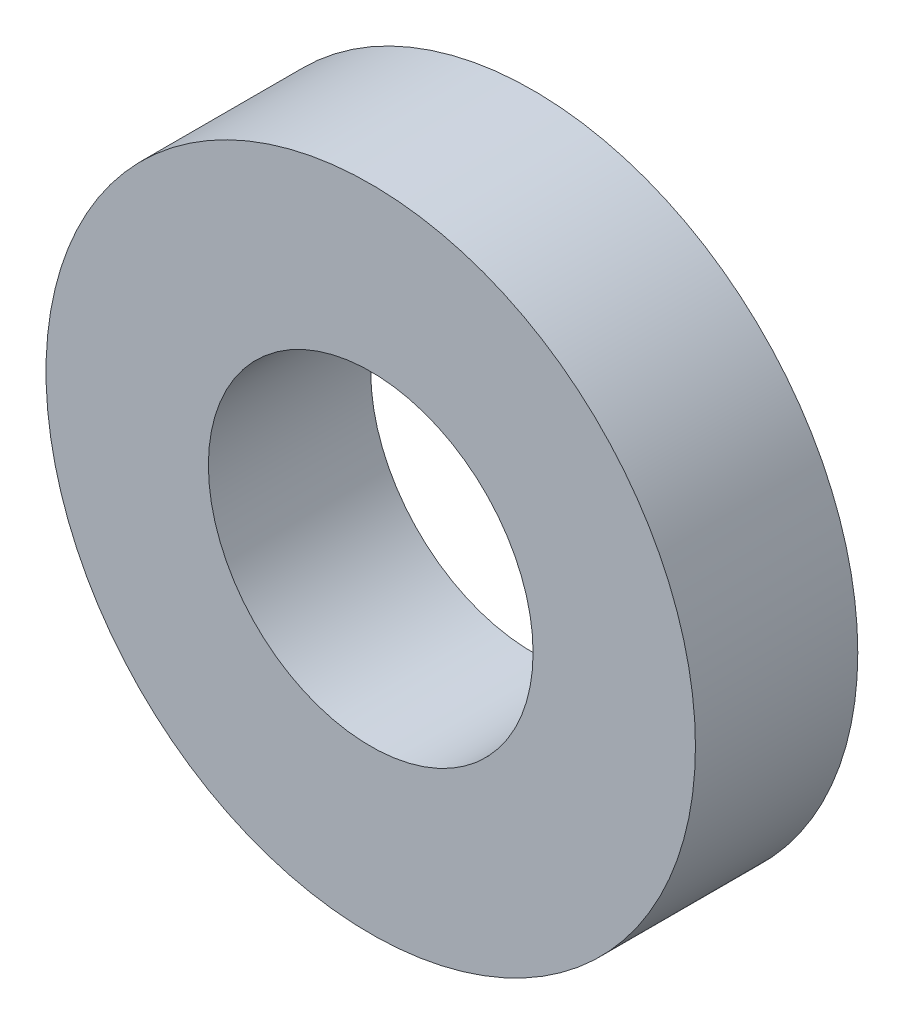
ISO-10303-21;
HEADER;
FILE_DESCRIPTION(('STEP AP214'),'2;1');
FILE_NAME('part.step','',(''),(''),'','','');
FILE_SCHEMA(('AUTOMOTIVE_DESIGN { 1 0 10303 214 1 1 1 1 }'));
ENDSEC;
DATA;
#1=APPLICATION_CONTEXT('core data for automotive mechanical design processes');
#2=APPLICATION_PROTOCOL_DEFINITION('international standard','automotive_design',2000,#1);
#3=PRODUCT_CONTEXT('',#1,'mechanical');
#4=PRODUCT('Part','Part','',(#3));
#5=PRODUCT_RELATED_PRODUCT_CATEGORY('part','',(#4));
#6=PRODUCT_DEFINITION_FORMATION('','',#4);
#7=PRODUCT_DEFINITION_CONTEXT('part definition',#1,'design');
#8=PRODUCT_DEFINITION('design','',#6,#7);
#9=PRODUCT_DEFINITION_SHAPE('','',#8);
#10=(LENGTH_UNIT() NAMED_UNIT(*) SI_UNIT(.MILLI.,.METRE.));
#11=(NAMED_UNIT(*) PLANE_ANGLE_UNIT() SI_UNIT($,.RADIAN.));
#12=(NAMED_UNIT(*) SI_UNIT($,.STERADIAN.) SOLID_ANGLE_UNIT());
#13=UNCERTAINTY_MEASURE_WITH_UNIT(LENGTH_MEASURE(1.E-05),#10,'distance_accuracy_value','');
#14=(GEOMETRIC_REPRESENTATION_CONTEXT(3) GLOBAL_UNCERTAINTY_ASSIGNED_CONTEXT((#13)) GLOBAL_UNIT_ASSIGNED_CONTEXT((#10,
#11,#12)) REPRESENTATION_CONTEXT('',''));
#15=CARTESIAN_POINT('',(0.,0.,0.));
#16=DIRECTION('',(0.,0.,1.));
#17=DIRECTION('',(1.,0.,0.));
#18=AXIS2_PLACEMENT_3D('',#15,#16,#17);
#19=CARTESIAN_POINT('',(0.,0.,10.));
#20=DIRECTION('',(0.,0.,1.));
#21=DIRECTION('',(1.,0.,0.));
#22=AXIS2_PLACEMENT_3D('',#19,#20,#21);
#23=PLANE('',#22);
#24=CARTESIAN_POINT('',(0.,0.,10.));
#25=DIRECTION('',(0.,0.,1.));
#26=DIRECTION('',(1.,0.,0.));
#27=AXIS2_PLACEMENT_3D('',#24,#25,#26);
#28=CIRCLE('',#27,20.);
#29=CARTESIAN_POINT('',(20.,0.,10.));
#30=VERTEX_POINT('',#29);
#31=EDGE_CURVE('E10',#30,#30,#28,.T.);
#32=ORIENTED_EDGE('',*,*,#31,.T.);
#33=EDGE_LOOP('',(#32));
#34=FACE_BOUND('',#33,.T.);
#35=CARTESIAN_POINT('',(0.,0.,10.));
#36=DIRECTION('',(0.,0.,1.));
#37=DIRECTION('',(1.,0.,0.));
#38=AXIS2_PLACEMENT_3D('',#35,#36,#37);
#39=CIRCLE('',#38,10.);
#40=CARTESIAN_POINT('',(10.,0.,10.));
#41=VERTEX_POINT('',#40);
#42=EDGE_CURVE('E50',#41,#41,#39,.T.);
#43=ORIENTED_EDGE('',*,*,#42,.F.);
#44=EDGE_LOOP('',(#43));
#45=FACE_BOUND('',#44,.T.);
#46=ADVANCED_FACE('F37',(#34,#45),#23,.T.);
#47=CARTESIAN_POINT('',(0.,0.,0.));
#48=DIRECTION('',(0.,0.,1.));
#49=DIRECTION('',(1.,0.,0.));
#50=AXIS2_PLACEMENT_3D('',#47,#48,#49);
#51=PLANE('',#50);
#52=CARTESIAN_POINT('',(0.,0.,0.));
#53=DIRECTION('',(0.,0.,1.));
#54=DIRECTION('',(1.,0.,0.));
#55=AXIS2_PLACEMENT_3D('',#52,#53,#54);
#56=CIRCLE('',#55,20.);
#57=CARTESIAN_POINT('',(20.,0.,0.));
#58=VERTEX_POINT('',#57);
#59=EDGE_CURVE('E41',#58,#58,#56,.T.);
#60=ORIENTED_EDGE('',*,*,#59,.F.);
#61=EDGE_LOOP('',(#60));
#62=FACE_BOUND('',#61,.T.);
#63=CARTESIAN_POINT('',(0.,0.,0.));
#64=DIRECTION('',(0.,0.,1.));
#65=DIRECTION('',(1.,0.,0.));
#66=AXIS2_PLACEMENT_3D('',#63,#64,#65);
#67=CIRCLE('',#66,10.);
#68=CARTESIAN_POINT('',(10.,0.,0.));
#69=VERTEX_POINT('',#68);
#70=EDGE_CURVE('E52',#69,#69,#67,.T.);
#71=ORIENTED_EDGE('',*,*,#70,.T.);
#72=EDGE_LOOP('',(#71));
#73=FACE_BOUND('',#72,.T.);
#74=ADVANCED_FACE('F64',(#62,#73),#51,.F.);
#75=CARTESIAN_POINT('',(0.,0.,10.));
#76=DIRECTION('',(0.,0.,-1.));
#77=DIRECTION('',(-1.,0.,0.));
#78=AXIS2_PLACEMENT_3D('',#75,#76,#77);
#79=CYLINDRICAL_SURFACE('',#78,20.);
#80=ORIENTED_EDGE('',*,*,#31,.F.);
#81=EDGE_LOOP('',(#80));
#82=FACE_BOUND('',#81,.T.);
#83=ORIENTED_EDGE('',*,*,#59,.T.);
#84=EDGE_LOOP('',(#83));
#85=FACE_BOUND('',#84,.T.);
#86=ADVANCED_FACE('F39',(#82,#85),#79,.T.);
#87=CARTESIAN_POINT('',(0.,0.,10.));
#88=DIRECTION('',(0.,0.,-1.));
#89=DIRECTION('',(-1.,0.,0.));
#90=AXIS2_PLACEMENT_3D('',#87,#88,#89);
#91=CYLINDRICAL_SURFACE('',#90,10.);
#92=ORIENTED_EDGE('',*,*,#42,.T.);
#93=EDGE_LOOP('',(#92));
#94=FACE_BOUND('',#93,.T.);
#95=ORIENTED_EDGE('',*,*,#70,.F.);
#96=EDGE_LOOP('',(#95));
#97=FACE_BOUND('',#96,.T.);
#98=ADVANCED_FACE('F60',(#94,#97),#91,.F.);
#99=CLOSED_SHELL('',(#46,#74,#86,#98));
#100=MANIFOLD_SOLID_BREP('B2',#99);
#101=ADVANCED_BREP_SHAPE_REPRESENTATION('',(#18,#100),#14);
#102=SHAPE_DEFINITION_REPRESENTATION(#9,#101);
ENDSEC;
END-ISO-10303-21;
